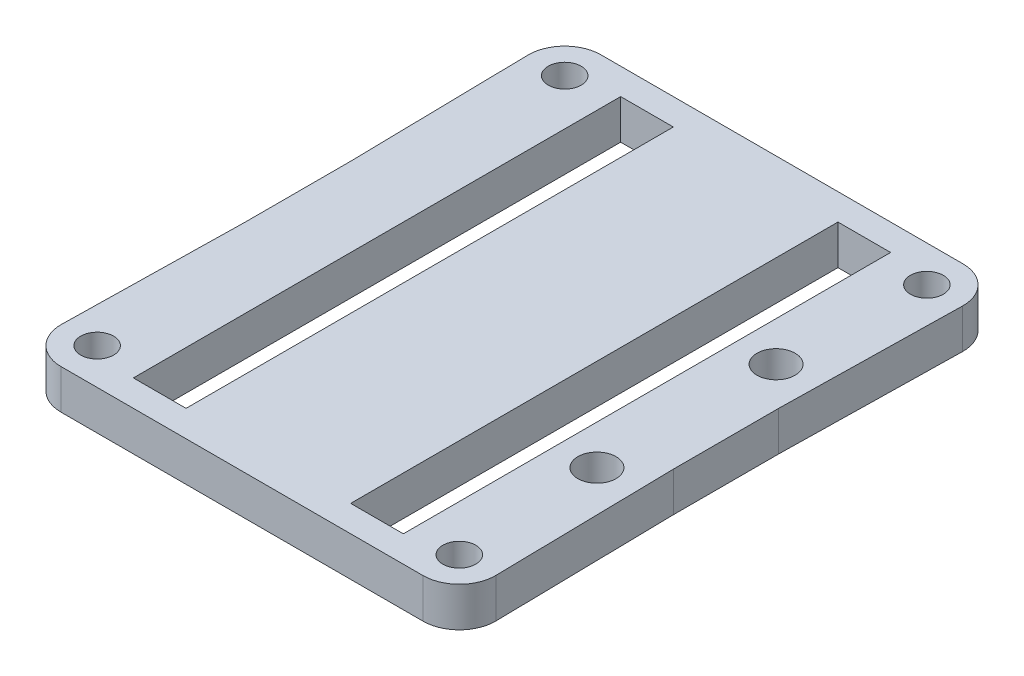
ISO-10303-21;
HEADER;
FILE_DESCRIPTION(('STEP AP214'),'2;1');
FILE_NAME('part.step','',(''),(''),'','','');
FILE_SCHEMA(('AUTOMOTIVE_DESIGN { 1 0 10303 214 1 1 1 1 }'));
ENDSEC;
DATA;
#1=APPLICATION_CONTEXT('core data for automotive mechanical design processes');
#2=APPLICATION_PROTOCOL_DEFINITION('international standard','automotive_design',2000,#1);
#3=PRODUCT_CONTEXT('',#1,'mechanical');
#4=PRODUCT('Part','Part','',(#3));
#5=PRODUCT_RELATED_PRODUCT_CATEGORY('part','',(#4));
#6=PRODUCT_DEFINITION_FORMATION('','',#4);
#7=PRODUCT_DEFINITION_CONTEXT('part definition',#1,'design');
#8=PRODUCT_DEFINITION('design','',#6,#7);
#9=PRODUCT_DEFINITION_SHAPE('','',#8);
#10=(LENGTH_UNIT() NAMED_UNIT(*) SI_UNIT(.MILLI.,.METRE.));
#11=(NAMED_UNIT(*) PLANE_ANGLE_UNIT() SI_UNIT($,.RADIAN.));
#12=(NAMED_UNIT(*) SI_UNIT($,.STERADIAN.) SOLID_ANGLE_UNIT());
#13=UNCERTAINTY_MEASURE_WITH_UNIT(LENGTH_MEASURE(1.E-05),#10,'distance_accuracy_value','');
#14=(GEOMETRIC_REPRESENTATION_CONTEXT(3) GLOBAL_UNCERTAINTY_ASSIGNED_CONTEXT((#13)) GLOBAL_UNIT_ASSIGNED_CONTEXT((#10,
#11,#12)) REPRESENTATION_CONTEXT('',''));
#15=CARTESIAN_POINT('',(0.,0.,0.));
#16=DIRECTION('',(0.,0.,1.));
#17=DIRECTION('',(1.,0.,0.));
#18=AXIS2_PLACEMENT_3D('',#15,#16,#17);
#19=CARTESIAN_POINT('',(-16.1717744553945,3.,-0.294568775175375));
#20=DIRECTION('',(0.999834148265548,0.,0.0182119730426275));
#21=DIRECTION('',(0.0182119730426275,0.,-0.999834148265549));
#22=AXIS2_PLACEMENT_3D('',#19,#20,#21);
#23=PLANE('',#22);
#24=DIRECTION('',(-0.0182119730426275,0.,0.999834148265549));
#25=VECTOR('',#24,1.);
#26=CARTESIAN_POINT('',(-16.1717744553945,0.,-0.294568775175375));
#27=LINE('',#26,#25);
#28=CARTESIAN_POINT('',(-16.25,0.,4.));
#29=VERTEX_POINT('',#28);
#30=CARTESIAN_POINT('',(-16.4995439077303,0.,17.6999170741328));
#31=VERTEX_POINT('',#30);
#32=EDGE_CURVE('E259',#29,#31,#27,.T.);
#33=ORIENTED_EDGE('',*,*,#32,.T.);
#34=DIRECTION('',(0.,-1.,0.));
#35=VECTOR('',#34,1.);
#36=CARTESIAN_POINT('',(-16.4995439077303,3.,17.6999170741328));
#37=LINE('',#36,#35);
#38=CARTESIAN_POINT('',(-16.4995439077303,3.,17.6999170741328));
#39=VERTEX_POINT('',#38);
#40=EDGE_CURVE('E11',#39,#31,#37,.T.);
#41=ORIENTED_EDGE('',*,*,#40,.F.);
#42=DIRECTION('',(-0.0182119730426275,0.,0.999834148265549));
#43=VECTOR('',#42,1.);
#44=CARTESIAN_POINT('',(-16.1717744553945,3.,-0.294568775175375));
#45=LINE('',#44,#43);
#46=CARTESIAN_POINT('',(-16.25,3.,4.));
#47=VERTEX_POINT('',#46);
#48=EDGE_CURVE('E476',#47,#39,#45,.T.);
#49=ORIENTED_EDGE('',*,*,#48,.F.);
#50=DIRECTION('',(0.,-1.,0.));
#51=VECTOR('',#50,1.);
#52=CARTESIAN_POINT('',(-16.25,3.,4.));
#53=LINE('',#52,#51);
#54=EDGE_CURVE('E300',#47,#29,#53,.T.);
#55=ORIENTED_EDGE('',*,*,#54,.T.);
#56=EDGE_LOOP('',(#33,#41,#49,#55));
#57=FACE_BOUND('',#56,.T.);
#58=ADVANCED_FACE('F42',(#57),#23,.F.);
#59=CARTESIAN_POINT('',(-13.75,3.,17.75));
#60=DIRECTION('',(0.,-1.,0.));
#61=DIRECTION('',(0.,0.,-1.));
#62=AXIS2_PLACEMENT_3D('',#59,#60,#61);
#63=CYLINDRICAL_SURFACE('',#62,2.75);
#64=CARTESIAN_POINT('',(-13.75,0.,17.75));
#65=DIRECTION('',(0.,1.,0.));
#66=DIRECTION('',(0.,0.,1.));
#67=AXIS2_PLACEMENT_3D('',#64,#65,#66);
#68=CIRCLE('',#67,2.75);
#69=CARTESIAN_POINT('',(-13.75,0.,20.5));
#70=VERTEX_POINT('',#69);
#71=EDGE_CURVE('E263',#31,#70,#68,.T.);
#72=ORIENTED_EDGE('',*,*,#71,.T.);
#73=DIRECTION('',(0.,-1.,0.));
#74=VECTOR('',#73,1.);
#75=CARTESIAN_POINT('',(-13.75,3.,20.5));
#76=LINE('',#75,#74);
#77=CARTESIAN_POINT('',(-13.75,3.,20.5));
#78=VERTEX_POINT('',#77);
#79=EDGE_CURVE('E53',#78,#70,#76,.T.);
#80=ORIENTED_EDGE('',*,*,#79,.F.);
#81=CARTESIAN_POINT('',(-13.75,3.,17.75));
#82=DIRECTION('',(0.,1.,0.));
#83=DIRECTION('',(0.,0.,1.));
#84=AXIS2_PLACEMENT_3D('',#81,#82,#83);
#85=CIRCLE('',#84,2.75);
#86=EDGE_CURVE('E479',#39,#78,#85,.T.);
#87=ORIENTED_EDGE('',*,*,#86,.F.);
#88=ORIENTED_EDGE('',*,*,#40,.T.);
#89=EDGE_LOOP('',(#72,#80,#87,#88));
#90=FACE_BOUND('',#89,.T.);
#91=ADVANCED_FACE('F388',(#90),#63,.T.);
#92=CARTESIAN_POINT('',(0.,3.,20.5));
#93=DIRECTION('',(0.,0.,1.));
#94=DIRECTION('',(1.,0.,0.));
#95=AXIS2_PLACEMENT_3D('',#92,#93,#94);
#96=PLANE('',#95);
#97=DIRECTION('',(-1.,0.,0.));
#98=VECTOR('',#97,1.);
#99=CARTESIAN_POINT('',(0.,0.,20.5));
#100=LINE('',#99,#98);
#101=CARTESIAN_POINT('',(13.75,0.,20.5));
#102=VERTEX_POINT('',#101);
#103=EDGE_CURVE('E267',#102,#70,#100,.T.);
#104=ORIENTED_EDGE('',*,*,#103,.F.);
#105=DIRECTION('',(0.,-1.,0.));
#106=VECTOR('',#105,1.);
#107=CARTESIAN_POINT('',(13.75,3.,20.5));
#108=LINE('',#107,#106);
#109=CARTESIAN_POINT('',(13.75,3.,20.5));
#110=VERTEX_POINT('',#109);
#111=EDGE_CURVE('E326',#110,#102,#108,.T.);
#112=ORIENTED_EDGE('',*,*,#111,.F.);
#113=DIRECTION('',(-1.,0.,0.));
#114=VECTOR('',#113,1.);
#115=CARTESIAN_POINT('',(0.,3.,20.5));
#116=LINE('',#115,#114);
#117=EDGE_CURVE('E482',#110,#78,#116,.T.);
#118=ORIENTED_EDGE('',*,*,#117,.T.);
#119=ORIENTED_EDGE('',*,*,#79,.T.);
#120=EDGE_LOOP('',(#104,#112,#118,#119));
#121=FACE_BOUND('',#120,.T.);
#122=ADVANCED_FACE('F394',(#121),#96,.T.);
#123=CARTESIAN_POINT('',(13.75,3.,17.75));
#124=DIRECTION('',(0.,-1.,0.));
#125=DIRECTION('',(0.,0.,-1.));
#126=AXIS2_PLACEMENT_3D('',#123,#124,#125);
#127=CYLINDRICAL_SURFACE('',#126,2.75);
#128=CARTESIAN_POINT('',(13.75,0.,17.75));
#129=DIRECTION('',(0.,1.,0.));
#130=DIRECTION('',(0.,0.,1.));
#131=AXIS2_PLACEMENT_3D('',#128,#129,#130);
#132=CIRCLE('',#131,2.75);
#133=CARTESIAN_POINT('',(16.4995439077303,0.,17.6999170741328));
#134=VERTEX_POINT('',#133);
#135=EDGE_CURVE('E271',#134,#102,#132,.F.);
#136=ORIENTED_EDGE('',*,*,#135,.F.);
#137=DIRECTION('',(0.,-1.,0.));
#138=VECTOR('',#137,1.);
#139=CARTESIAN_POINT('',(16.4995439077303,3.,17.6999170741328));
#140=LINE('',#139,#138);
#141=CARTESIAN_POINT('',(16.4995439077303,3.,17.6999170741328));
#142=VERTEX_POINT('',#141);
#143=EDGE_CURVE('E323',#142,#134,#140,.T.);
#144=ORIENTED_EDGE('',*,*,#143,.F.);
#145=CARTESIAN_POINT('',(13.75,3.,17.75));
#146=DIRECTION('',(0.,1.,0.));
#147=DIRECTION('',(0.,0.,1.));
#148=AXIS2_PLACEMENT_3D('',#145,#146,#147);
#149=CIRCLE('',#148,2.75);
#150=EDGE_CURVE('E486',#142,#110,#149,.F.);
#151=ORIENTED_EDGE('',*,*,#150,.T.);
#152=ORIENTED_EDGE('',*,*,#111,.T.);
#153=EDGE_LOOP('',(#136,#144,#151,#152));
#154=FACE_BOUND('',#153,.T.);
#155=ADVANCED_FACE('F560',(#154),#127,.T.);
#156=CARTESIAN_POINT('',(16.1717744553945,3.,-0.294568775175375));
#157=DIRECTION('',(0.999834148265548,0.,-0.0182119730426275));
#158=DIRECTION('',(-0.0182119730426275,0.,-0.999834148265549));
#159=AXIS2_PLACEMENT_3D('',#156,#157,#158);
#160=PLANE('',#159);
#161=DIRECTION('',(0.0182119730426275,0.,0.999834148265549));
#162=VECTOR('',#161,1.);
#163=CARTESIAN_POINT('',(16.1717744553945,0.,-0.294568775175375));
#164=LINE('',#163,#162);
#165=CARTESIAN_POINT('',(16.25,0.,4.));
#166=VERTEX_POINT('',#165);
#167=EDGE_CURVE('E275',#166,#134,#164,.T.);
#168=ORIENTED_EDGE('',*,*,#167,.F.);
#169=DIRECTION('',(0.,-1.,0.));
#170=VECTOR('',#169,1.);
#171=CARTESIAN_POINT('',(16.25,3.,4.));
#172=LINE('',#171,#170);
#173=CARTESIAN_POINT('',(16.25,3.,4.));
#174=VERTEX_POINT('',#173);
#175=EDGE_CURVE('E320',#174,#166,#172,.T.);
#176=ORIENTED_EDGE('',*,*,#175,.F.);
#177=DIRECTION('',(0.0182119730426275,0.,0.999834148265549));
#178=VECTOR('',#177,1.);
#179=CARTESIAN_POINT('',(16.1717744553945,3.,-0.294568775175375));
#180=LINE('',#179,#178);
#181=EDGE_CURVE('E490',#174,#142,#180,.T.);
#182=ORIENTED_EDGE('',*,*,#181,.T.);
#183=ORIENTED_EDGE('',*,*,#143,.T.);
#184=EDGE_LOOP('',(#168,#176,#182,#183));
#185=FACE_BOUND('',#184,.T.);
#186=ADVANCED_FACE('F556',(#185),#160,.T.);
#187=CARTESIAN_POINT('',(16.25,3.,0.));
#188=DIRECTION('',(-1.,0.,0.));
#189=DIRECTION('',(0.,0.,1.));
#190=AXIS2_PLACEMENT_3D('',#187,#188,#189);
#191=PLANE('',#190);
#192=DIRECTION('',(0.,0.,-1.));
#193=VECTOR('',#192,1.);
#194=CARTESIAN_POINT('',(16.25,0.,0.));
#195=LINE('',#194,#193);
#196=CARTESIAN_POINT('',(16.25,0.,-4.));
#197=VERTEX_POINT('',#196);
#198=EDGE_CURVE('E279',#166,#197,#195,.T.);
#199=ORIENTED_EDGE('',*,*,#198,.T.);
#200=DIRECTION('',(0.,-1.,0.));
#201=VECTOR('',#200,1.);
#202=CARTESIAN_POINT('',(16.25,3.,-4.));
#203=LINE('',#202,#201);
#204=CARTESIAN_POINT('',(16.25,3.,-4.));
#205=VERTEX_POINT('',#204);
#206=EDGE_CURVE('E316',#205,#197,#203,.T.);
#207=ORIENTED_EDGE('',*,*,#206,.F.);
#208=DIRECTION('',(0.,0.,-1.));
#209=VECTOR('',#208,1.);
#210=CARTESIAN_POINT('',(16.25,3.,0.));
#211=LINE('',#210,#209);
#212=EDGE_CURVE('E494',#174,#205,#211,.T.);
#213=ORIENTED_EDGE('',*,*,#212,.F.);
#214=ORIENTED_EDGE('',*,*,#175,.T.);
#215=EDGE_LOOP('',(#199,#207,#213,#214));
#216=FACE_BOUND('',#215,.T.);
#217=ADVANCED_FACE('F552',(#216),#191,.F.);
#218=CARTESIAN_POINT('',(16.1717744553945,3.,0.294568775175375));
#219=DIRECTION('',(-0.999834148265548,0.,-0.0182119730426275));
#220=DIRECTION('',(-0.0182119730426275,0.,0.999834148265549));
#221=AXIS2_PLACEMENT_3D('',#218,#219,#220);
#222=PLANE('',#221);
#223=DIRECTION('',(0.0182119730426275,0.,-0.999834148265549));
#224=VECTOR('',#223,1.);
#225=CARTESIAN_POINT('',(16.1717744553945,0.,0.294568775175375));
#226=LINE('',#225,#224);
#227=CARTESIAN_POINT('',(16.4995439077303,0.,-17.6999170741328));
#228=VERTEX_POINT('',#227);
#229=EDGE_CURVE('E282',#197,#228,#226,.T.);
#230=ORIENTED_EDGE('',*,*,#229,.T.);
#231=DIRECTION('',(0.,-1.,0.));
#232=VECTOR('',#231,1.);
#233=CARTESIAN_POINT('',(16.4995439077303,3.,-17.6999170741328));
#234=LINE('',#233,#232);
#235=CARTESIAN_POINT('',(16.4995439077303,3.,-17.6999170741328));
#236=VERTEX_POINT('',#235);
#237=EDGE_CURVE('E312',#236,#228,#234,.T.);
#238=ORIENTED_EDGE('',*,*,#237,.F.);
#239=DIRECTION('',(0.0182119730426275,0.,-0.999834148265549));
#240=VECTOR('',#239,1.);
#241=CARTESIAN_POINT('',(16.1717744553945,3.,0.294568775175375));
#242=LINE('',#241,#240);
#243=EDGE_CURVE('E497',#205,#236,#242,.T.);
#244=ORIENTED_EDGE('',*,*,#243,.F.);
#245=ORIENTED_EDGE('',*,*,#206,.T.);
#246=EDGE_LOOP('',(#230,#238,#244,#245));
#247=FACE_BOUND('',#246,.T.);
#248=ADVANCED_FACE('F548',(#247),#222,.F.);
#249=CARTESIAN_POINT('',(13.75,3.,-17.75));
#250=DIRECTION('',(0.,-1.,0.));
#251=DIRECTION('',(0.,0.,-1.));
#252=AXIS2_PLACEMENT_3D('',#249,#250,#251);
#253=CYLINDRICAL_SURFACE('',#252,2.75);
#254=CARTESIAN_POINT('',(13.75,0.,-17.75));
#255=DIRECTION('',(0.,1.,0.));
#256=DIRECTION('',(0.,0.,1.));
#257=AXIS2_PLACEMENT_3D('',#254,#255,#256);
#258=CIRCLE('',#257,2.75);
#259=CARTESIAN_POINT('',(13.75,0.,-20.5));
#260=VERTEX_POINT('',#259);
#261=EDGE_CURVE('E285',#228,#260,#258,.T.);
#262=ORIENTED_EDGE('',*,*,#261,.T.);
#263=DIRECTION('',(0.,-1.,0.));
#264=VECTOR('',#263,1.);
#265=CARTESIAN_POINT('',(13.75,3.,-20.5));
#266=LINE('',#265,#264);
#267=CARTESIAN_POINT('',(13.75,3.,-20.5));
#268=VERTEX_POINT('',#267);
#269=EDGE_CURVE('E308',#268,#260,#266,.T.);
#270=ORIENTED_EDGE('',*,*,#269,.F.);
#271=CARTESIAN_POINT('',(13.75,3.,-17.75));
#272=DIRECTION('',(0.,1.,0.));
#273=DIRECTION('',(0.,0.,1.));
#274=AXIS2_PLACEMENT_3D('',#271,#272,#273);
#275=CIRCLE('',#274,2.75);
#276=EDGE_CURVE('E500',#236,#268,#275,.T.);
#277=ORIENTED_EDGE('',*,*,#276,.F.);
#278=ORIENTED_EDGE('',*,*,#237,.T.);
#279=EDGE_LOOP('',(#262,#270,#277,#278));
#280=FACE_BOUND('',#279,.T.);
#281=ADVANCED_FACE('F544',(#280),#253,.T.);
#282=CARTESIAN_POINT('',(0.,3.,-20.5));
#283=DIRECTION('',(0.,0.,1.));
#284=DIRECTION('',(1.,0.,0.));
#285=AXIS2_PLACEMENT_3D('',#282,#283,#284);
#286=PLANE('',#285);
#287=DIRECTION('',(-1.,0.,0.));
#288=VECTOR('',#287,1.);
#289=CARTESIAN_POINT('',(0.,0.,-20.5));
#290=LINE('',#289,#288);
#291=CARTESIAN_POINT('',(-13.75,0.,-20.5));
#292=VERTEX_POINT('',#291);
#293=EDGE_CURVE('E288',#260,#292,#290,.T.);
#294=ORIENTED_EDGE('',*,*,#293,.T.);
#295=DIRECTION('',(0.,-1.,0.));
#296=VECTOR('',#295,1.);
#297=CARTESIAN_POINT('',(-13.75,3.,-20.5));
#298=LINE('',#297,#296);
#299=CARTESIAN_POINT('',(-13.75,3.,-20.5));
#300=VERTEX_POINT('',#299);
#301=EDGE_CURVE('E200',#300,#292,#298,.T.);
#302=ORIENTED_EDGE('',*,*,#301,.F.);
#303=DIRECTION('',(-1.,0.,0.));
#304=VECTOR('',#303,1.);
#305=CARTESIAN_POINT('',(0.,3.,-20.5));
#306=LINE('',#305,#304);
#307=EDGE_CURVE('E205',#268,#300,#306,.T.);
#308=ORIENTED_EDGE('',*,*,#307,.F.);
#309=ORIENTED_EDGE('',*,*,#269,.T.);
#310=EDGE_LOOP('',(#294,#302,#308,#309));
#311=FACE_BOUND('',#310,.T.);
#312=ADVANCED_FACE('F541',(#311),#286,.F.);
#313=CARTESIAN_POINT('',(-13.75,3.,-17.75));
#314=DIRECTION('',(0.,-1.,0.));
#315=DIRECTION('',(0.,0.,-1.));
#316=AXIS2_PLACEMENT_3D('',#313,#314,#315);
#317=CYLINDRICAL_SURFACE('',#316,2.75);
#318=CARTESIAN_POINT('',(-13.75,0.,-17.75));
#319=DIRECTION('',(0.,1.,0.));
#320=DIRECTION('',(0.,0.,1.));
#321=AXIS2_PLACEMENT_3D('',#318,#319,#320);
#322=CIRCLE('',#321,2.75);
#323=CARTESIAN_POINT('',(-16.4995439077303,0.,-17.6999170741328));
#324=VERTEX_POINT('',#323);
#325=EDGE_CURVE('E194',#324,#292,#322,.F.);
#326=ORIENTED_EDGE('',*,*,#325,.F.);
#327=DIRECTION('',(0.,-1.,0.));
#328=VECTOR('',#327,1.);
#329=CARTESIAN_POINT('',(-16.4995439077303,3.,-17.6999170741328));
#330=LINE('',#329,#328);
#331=CARTESIAN_POINT('',(-16.4995439077303,3.,-17.6999170741328));
#332=VERTEX_POINT('',#331);
#333=EDGE_CURVE('E189',#332,#324,#330,.T.);
#334=ORIENTED_EDGE('',*,*,#333,.F.);
#335=CARTESIAN_POINT('',(-13.75,3.,-17.75));
#336=DIRECTION('',(0.,1.,0.));
#337=DIRECTION('',(0.,0.,1.));
#338=AXIS2_PLACEMENT_3D('',#335,#336,#337);
#339=CIRCLE('',#338,2.75);
#340=EDGE_CURVE('E192',#332,#300,#339,.F.);
#341=ORIENTED_EDGE('',*,*,#340,.T.);
#342=ORIENTED_EDGE('',*,*,#301,.T.);
#343=EDGE_LOOP('',(#326,#334,#341,#342));
#344=FACE_BOUND('',#343,.T.);
#345=ADVANCED_FACE('F191',(#344),#317,.T.);
#346=CARTESIAN_POINT('',(-16.1717744553945,3.,0.294568775175375));
#347=DIRECTION('',(-0.999834148265548,0.,0.0182119730426275));
#348=DIRECTION('',(0.0182119730426275,0.,0.999834148265549));
#349=AXIS2_PLACEMENT_3D('',#346,#347,#348);
#350=PLANE('',#349);
#351=DIRECTION('',(-0.0182119730426275,0.,-0.999834148265549));
#352=VECTOR('',#351,1.);
#353=CARTESIAN_POINT('',(-16.1717744553945,0.,0.294568775175375));
#354=LINE('',#353,#352);
#355=CARTESIAN_POINT('',(-16.25,0.,-4.));
#356=VERTEX_POINT('',#355);
#357=EDGE_CURVE('E294',#356,#324,#354,.T.);
#358=ORIENTED_EDGE('',*,*,#357,.F.);
#359=DIRECTION('',(0.,-1.,0.));
#360=VECTOR('',#359,1.);
#361=CARTESIAN_POINT('',(-16.25,3.,-4.));
#362=LINE('',#361,#360);
#363=CARTESIAN_POINT('',(-16.25,3.,-4.));
#364=VERTEX_POINT('',#363);
#365=EDGE_CURVE('E126',#364,#356,#362,.T.);
#366=ORIENTED_EDGE('',*,*,#365,.F.);
#367=DIRECTION('',(-0.0182119730426275,0.,-0.999834148265549));
#368=VECTOR('',#367,1.);
#369=CARTESIAN_POINT('',(-16.1717744553945,3.,0.294568775175375));
#370=LINE('',#369,#368);
#371=EDGE_CURVE('E203',#364,#332,#370,.T.);
#372=ORIENTED_EDGE('',*,*,#371,.T.);
#373=ORIENTED_EDGE('',*,*,#333,.T.);
#374=EDGE_LOOP('',(#358,#366,#372,#373));
#375=FACE_BOUND('',#374,.T.);
#376=ADVANCED_FACE('F209',(#375),#350,.T.);
#377=CARTESIAN_POINT('',(0.,3.,-18.5));
#378=DIRECTION('',(0.,0.,1.));
#379=DIRECTION('',(1.,0.,0.));
#380=AXIS2_PLACEMENT_3D('',#377,#378,#379);
#381=PLANE('',#380);
#382=DIRECTION('',(-1.,0.,0.));
#383=VECTOR('',#382,1.);
#384=CARTESIAN_POINT('',(0.,0.,-18.5));
#385=LINE('',#384,#383);
#386=CARTESIAN_POINT('',(10.25,0.,-18.5));
#387=VERTEX_POINT('',#386);
#388=CARTESIAN_POINT('',(6.25,0.,-18.5));
#389=VERTEX_POINT('',#388);
#390=EDGE_CURVE('E223',#387,#389,#385,.T.);
#391=ORIENTED_EDGE('',*,*,#390,.F.);
#392=DIRECTION('',(0.,-1.,0.));
#393=VECTOR('',#392,1.);
#394=CARTESIAN_POINT('',(10.25,3.,-18.5));
#395=LINE('',#394,#393);
#396=CARTESIAN_POINT('',(10.25,3.,-18.5));
#397=VERTEX_POINT('',#396);
#398=EDGE_CURVE('E303',#397,#387,#395,.T.);
#399=ORIENTED_EDGE('',*,*,#398,.F.);
#400=DIRECTION('',(-1.,0.,0.));
#401=VECTOR('',#400,1.);
#402=CARTESIAN_POINT('',(0.,3.,-18.5));
#403=LINE('',#402,#401);
#404=CARTESIAN_POINT('',(6.25,3.,-18.5));
#405=VERTEX_POINT('',#404);
#406=EDGE_CURVE('E444',#397,#405,#403,.T.);
#407=ORIENTED_EDGE('',*,*,#406,.T.);
#408=DIRECTION('',(0.,-1.,0.));
#409=VECTOR('',#408,1.);
#410=CARTESIAN_POINT('',(6.25,3.,-18.5));
#411=LINE('',#410,#409);
#412=EDGE_CURVE('E331',#405,#389,#411,.T.);
#413=ORIENTED_EDGE('',*,*,#412,.T.);
#414=EDGE_LOOP('',(#391,#399,#407,#413));
#415=FACE_BOUND('',#414,.T.);
#416=ADVANCED_FACE('F509',(#415),#381,.T.);
#417=CARTESIAN_POINT('',(10.25,3.,0.));
#418=DIRECTION('',(1.,0.,0.));
#419=DIRECTION('',(0.,0.,-1.));
#420=AXIS2_PLACEMENT_3D('',#417,#418,#419);
#421=PLANE('',#420);
#422=DIRECTION('',(0.,0.,1.));
#423=VECTOR('',#422,1.);
#424=CARTESIAN_POINT('',(10.25,0.,0.));
#425=LINE('',#424,#423);
#426=CARTESIAN_POINT('',(10.25,0.,18.5));
#427=VERTEX_POINT('',#426);
#428=EDGE_CURVE('E243',#387,#427,#425,.T.);
#429=ORIENTED_EDGE('',*,*,#428,.T.);
#430=DIRECTION('',(0.,-1.,0.));
#431=VECTOR('',#430,1.);
#432=CARTESIAN_POINT('',(10.25,3.,18.5));
#433=LINE('',#432,#431);
#434=CARTESIAN_POINT('',(10.25,3.,18.5));
#435=VERTEX_POINT('',#434);
#436=EDGE_CURVE('E337',#435,#427,#433,.T.);
#437=ORIENTED_EDGE('',*,*,#436,.F.);
#438=DIRECTION('',(0.,0.,1.));
#439=VECTOR('',#438,1.);
#440=CARTESIAN_POINT('',(10.25,3.,0.));
#441=LINE('',#440,#439);
#442=EDGE_CURVE('E461',#397,#435,#441,.T.);
#443=ORIENTED_EDGE('',*,*,#442,.F.);
#444=ORIENTED_EDGE('',*,*,#398,.T.);
#445=EDGE_LOOP('',(#429,#437,#443,#444));
#446=FACE_BOUND('',#445,.T.);
#447=ADVANCED_FACE('F385',(#446),#421,.F.);
#448=CARTESIAN_POINT('',(0.,3.,18.5));
#449=DIRECTION('',(0.,0.,1.));
#450=DIRECTION('',(1.,0.,0.));
#451=AXIS2_PLACEMENT_3D('',#448,#449,#450);
#452=PLANE('',#451);
#453=DIRECTION('',(-1.,0.,0.));
#454=VECTOR('',#453,1.);
#455=CARTESIAN_POINT('',(0.,0.,18.5));
#456=LINE('',#455,#454);
#457=CARTESIAN_POINT('',(6.25,0.,18.5));
#458=VERTEX_POINT('',#457);
#459=EDGE_CURVE('E231',#427,#458,#456,.T.);
#460=ORIENTED_EDGE('',*,*,#459,.T.);
#461=DIRECTION('',(0.,-1.,0.));
#462=VECTOR('',#461,1.);
#463=CARTESIAN_POINT('',(6.25,3.,18.5));
#464=LINE('',#463,#462);
#465=CARTESIAN_POINT('',(6.25,3.,18.5));
#466=VERTEX_POINT('',#465);
#467=EDGE_CURVE('E334',#466,#458,#464,.T.);
#468=ORIENTED_EDGE('',*,*,#467,.F.);
#469=DIRECTION('',(-1.,0.,0.));
#470=VECTOR('',#469,1.);
#471=CARTESIAN_POINT('',(0.,3.,18.5));
#472=LINE('',#471,#470);
#473=EDGE_CURVE('E450',#435,#466,#472,.T.);
#474=ORIENTED_EDGE('',*,*,#473,.F.);
#475=ORIENTED_EDGE('',*,*,#436,.T.);
#476=EDGE_LOOP('',(#460,#468,#474,#475));
#477=FACE_BOUND('',#476,.T.);
#478=ADVANCED_FACE('F374',(#477),#452,.F.);
#479=CARTESIAN_POINT('',(-6.25,0.,-18.5));
#480=VERTEX_POINT('',#479);
#481=CARTESIAN_POINT('',(-10.25,0.,-18.5));
#482=VERTEX_POINT('',#481);
#483=EDGE_CURVE('E217',#480,#482,#385,.T.);
#484=ORIENTED_EDGE('',*,*,#483,.F.);
#485=DIRECTION('',(0.,-1.,0.));
#486=VECTOR('',#485,1.);
#487=CARTESIAN_POINT('',(-6.25,3.,-18.5));
#488=LINE('',#487,#486);
#489=CARTESIAN_POINT('',(-6.25,3.,-18.5));
#490=VERTEX_POINT('',#489);
#491=EDGE_CURVE('E46',#490,#480,#488,.T.);
#492=ORIENTED_EDGE('',*,*,#491,.F.);
#493=CARTESIAN_POINT('',(-10.25,3.,-18.5));
#494=VERTEX_POINT('',#493);
#495=EDGE_CURVE('E299',#490,#494,#403,.T.);
#496=ORIENTED_EDGE('',*,*,#495,.T.);
#497=DIRECTION('',(0.,-1.,0.));
#498=VECTOR('',#497,1.);
#499=CARTESIAN_POINT('',(-10.25,3.,-18.5));
#500=LINE('',#499,#498);
#501=EDGE_CURVE('E213',#494,#482,#500,.T.);
#502=ORIENTED_EDGE('',*,*,#501,.T.);
#503=EDGE_LOOP('',(#484,#492,#496,#502));
#504=FACE_BOUND('',#503,.T.);
#505=ADVANCED_FACE('F363',(#504),#381,.T.);
#506=CARTESIAN_POINT('',(-6.25,3.,0.));
#507=DIRECTION('',(1.,0.,0.));
#508=DIRECTION('',(0.,0.,-1.));
#509=AXIS2_PLACEMENT_3D('',#506,#507,#508);
#510=PLANE('',#509);
#511=DIRECTION('',(0.,0.,1.));
#512=VECTOR('',#511,1.);
#513=CARTESIAN_POINT('',(-6.25,0.,0.));
#514=LINE('',#513,#512);
#515=CARTESIAN_POINT('',(-6.25,0.,18.5));
#516=VERTEX_POINT('',#515);
#517=EDGE_CURVE('E221',#480,#516,#514,.T.);
#518=ORIENTED_EDGE('',*,*,#517,.T.);
#519=DIRECTION('',(0.,-1.,0.));
#520=VECTOR('',#519,1.);
#521=CARTESIAN_POINT('',(-6.25,3.,18.5));
#522=LINE('',#521,#520);
#523=CARTESIAN_POINT('',(-6.25,3.,18.5));
#524=VERTEX_POINT('',#523);
#525=EDGE_CURVE('E347',#524,#516,#522,.T.);
#526=ORIENTED_EDGE('',*,*,#525,.F.);
#527=DIRECTION('',(0.,0.,1.));
#528=VECTOR('',#527,1.);
#529=CARTESIAN_POINT('',(-6.25,3.,0.));
#530=LINE('',#529,#528);
#531=EDGE_CURVE('E357',#490,#524,#530,.T.);
#532=ORIENTED_EDGE('',*,*,#531,.F.);
#533=ORIENTED_EDGE('',*,*,#491,.T.);
#534=EDGE_LOOP('',(#518,#526,#532,#533));
#535=FACE_BOUND('',#534,.T.);
#536=ADVANCED_FACE('F44',(#535),#510,.F.);
#537=CARTESIAN_POINT('',(-10.25,0.,18.5));
#538=VERTEX_POINT('',#537);
#539=EDGE_CURVE('E226',#516,#538,#456,.T.);
#540=ORIENTED_EDGE('',*,*,#539,.T.);
#541=DIRECTION('',(0.,-1.,0.));
#542=VECTOR('',#541,1.);
#543=CARTESIAN_POINT('',(-10.25,3.,18.5));
#544=LINE('',#543,#542);
#545=CARTESIAN_POINT('',(-10.25,3.,18.5));
#546=VERTEX_POINT('',#545);
#547=EDGE_CURVE('E345',#546,#538,#544,.T.);
#548=ORIENTED_EDGE('',*,*,#547,.F.);
#549=EDGE_CURVE('E447',#524,#546,#472,.T.);
#550=ORIENTED_EDGE('',*,*,#549,.F.);
#551=ORIENTED_EDGE('',*,*,#525,.T.);
#552=EDGE_LOOP('',(#540,#548,#550,#551));
#553=FACE_BOUND('',#552,.T.);
#554=ADVANCED_FACE('F370',(#553),#452,.F.);
#555=CARTESIAN_POINT('',(13.75,3.,17.75));
#556=DIRECTION('',(0.,-1.,0.));
#557=DIRECTION('',(0.,0.,-1.));
#558=AXIS2_PLACEMENT_3D('',#555,#556,#557);
#559=CYLINDRICAL_SURFACE('',#558,1.25);
#560=CARTESIAN_POINT('',(13.75,3.,17.75));
#561=DIRECTION('',(0.,1.,0.));
#562=DIRECTION('',(0.,0.,1.));
#563=AXIS2_PLACEMENT_3D('',#560,#561,#562);
#564=CIRCLE('',#563,1.25);
#565=CARTESIAN_POINT('',(13.75,3.,19.));
#566=VERTEX_POINT('',#565);
#567=EDGE_CURVE('E472',#566,#566,#564,.F.);
#568=ORIENTED_EDGE('',*,*,#567,.F.);
#569=EDGE_LOOP('',(#568));
#570=FACE_BOUND('',#569,.T.);
#571=CARTESIAN_POINT('',(13.75,0.,17.75));
#572=DIRECTION('',(0.,1.,0.));
#573=DIRECTION('',(0.,0.,1.));
#574=AXIS2_PLACEMENT_3D('',#571,#572,#573);
#575=CIRCLE('',#574,1.25);
#576=CARTESIAN_POINT('',(13.75,0.,19.));
#577=VERTEX_POINT('',#576);
#578=EDGE_CURVE('E255',#577,#577,#575,.F.);
#579=ORIENTED_EDGE('',*,*,#578,.T.);
#580=EDGE_LOOP('',(#579));
#581=FACE_BOUND('',#580,.T.);
#582=ADVANCED_FACE('F372',(#570,#581),#559,.F.);
#583=CARTESIAN_POINT('',(13.75,3.,-17.75));
#584=DIRECTION('',(0.,-1.,0.));
#585=DIRECTION('',(0.,0.,-1.));
#586=AXIS2_PLACEMENT_3D('',#583,#584,#585);
#587=CYLINDRICAL_SURFACE('',#586,1.25);
#588=CARTESIAN_POINT('',(13.75,3.,-17.75));
#589=DIRECTION('',(0.,1.,0.));
#590=DIRECTION('',(0.,0.,1.));
#591=AXIS2_PLACEMENT_3D('',#588,#589,#590);
#592=CIRCLE('',#591,1.25);
#593=CARTESIAN_POINT('',(13.75,3.,-16.5));
#594=VERTEX_POINT('',#593);
#595=EDGE_CURVE('E468',#594,#594,#592,.T.);
#596=ORIENTED_EDGE('',*,*,#595,.T.);
#597=EDGE_LOOP('',(#596));
#598=FACE_BOUND('',#597,.T.);
#599=CARTESIAN_POINT('',(13.75,0.,-17.75));
#600=DIRECTION('',(0.,1.,0.));
#601=DIRECTION('',(0.,0.,1.));
#602=AXIS2_PLACEMENT_3D('',#599,#600,#601);
#603=CIRCLE('',#602,1.25);
#604=CARTESIAN_POINT('',(13.75,0.,-16.5));
#605=VERTEX_POINT('',#604);
#606=EDGE_CURVE('E251',#605,#605,#603,.T.);
#607=ORIENTED_EDGE('',*,*,#606,.F.);
#608=EDGE_LOOP('',(#607));
#609=FACE_BOUND('',#608,.T.);
#610=ADVANCED_FACE('F379',(#598,#609),#587,.F.);
#611=CARTESIAN_POINT('',(6.25,3.,0.));
#612=DIRECTION('',(1.,0.,0.));
#613=DIRECTION('',(0.,0.,-1.));
#614=AXIS2_PLACEMENT_3D('',#611,#612,#613);
#615=PLANE('',#614);
#616=DIRECTION('',(0.,0.,1.));
#617=VECTOR('',#616,1.);
#618=CARTESIAN_POINT('',(6.25,0.,0.));
#619=LINE('',#618,#617);
#620=EDGE_CURVE('E247',#389,#458,#619,.T.);
#621=ORIENTED_EDGE('',*,*,#620,.F.);
#622=ORIENTED_EDGE('',*,*,#412,.F.);
#623=DIRECTION('',(0.,0.,1.));
#624=VECTOR('',#623,1.);
#625=CARTESIAN_POINT('',(6.25,3.,0.));
#626=LINE('',#625,#624);
#627=EDGE_CURVE('E465',#405,#466,#626,.T.);
#628=ORIENTED_EDGE('',*,*,#627,.T.);
#629=ORIENTED_EDGE('',*,*,#467,.T.);
#630=EDGE_LOOP('',(#621,#622,#628,#629));
#631=FACE_BOUND('',#630,.T.);
#632=ADVANCED_FACE('F400',(#631),#615,.T.);
#633=CARTESIAN_POINT('',(-13.75,3.,-17.75));
#634=DIRECTION('',(0.,-1.,0.));
#635=DIRECTION('',(0.,0.,-1.));
#636=AXIS2_PLACEMENT_3D('',#633,#634,#635);
#637=CYLINDRICAL_SURFACE('',#636,1.25000000000001);
#638=CARTESIAN_POINT('',(-13.75,3.,-17.75));
#639=DIRECTION('',(0.,1.,0.));
#640=DIRECTION('',(0.,0.,1.));
#641=AXIS2_PLACEMENT_3D('',#638,#639,#640);
#642=CIRCLE('',#641,1.25000000000001);
#643=CARTESIAN_POINT('',(-13.75,3.,-16.5));
#644=VERTEX_POINT('',#643);
#645=EDGE_CURVE('E457',#644,#644,#642,.F.);
#646=ORIENTED_EDGE('',*,*,#645,.F.);
#647=EDGE_LOOP('',(#646));
#648=FACE_BOUND('',#647,.T.);
#649=CARTESIAN_POINT('',(-13.75,0.,-17.75));
#650=DIRECTION('',(0.,1.,0.));
#651=DIRECTION('',(0.,0.,1.));
#652=AXIS2_PLACEMENT_3D('',#649,#650,#651);
#653=CIRCLE('',#652,1.25000000000001);
#654=CARTESIAN_POINT('',(-13.75,0.,-16.5));
#655=VERTEX_POINT('',#654);
#656=EDGE_CURVE('E239',#655,#655,#653,.F.);
#657=ORIENTED_EDGE('',*,*,#656,.T.);
#658=EDGE_LOOP('',(#657));
#659=FACE_BOUND('',#658,.T.);
#660=ADVANCED_FACE('F403',(#648,#659),#637,.F.);
#661=CARTESIAN_POINT('',(-13.75,3.,17.75));
#662=DIRECTION('',(0.,-1.,0.));
#663=DIRECTION('',(0.,0.,-1.));
#664=AXIS2_PLACEMENT_3D('',#661,#662,#663);
#665=CYLINDRICAL_SURFACE('',#664,1.25);
#666=CARTESIAN_POINT('',(-13.75,3.,17.75));
#667=DIRECTION('',(0.,1.,0.));
#668=DIRECTION('',(0.,0.,1.));
#669=AXIS2_PLACEMENT_3D('',#666,#667,#668);
#670=CIRCLE('',#669,1.25);
#671=CARTESIAN_POINT('',(-13.75,3.,19.));
#672=VERTEX_POINT('',#671);
#673=EDGE_CURVE('E453',#672,#672,#670,.T.);
#674=ORIENTED_EDGE('',*,*,#673,.T.);
#675=EDGE_LOOP('',(#674));
#676=FACE_BOUND('',#675,.T.);
#677=CARTESIAN_POINT('',(-13.75,0.,17.75));
#678=DIRECTION('',(0.,1.,0.));
#679=DIRECTION('',(0.,0.,1.));
#680=AXIS2_PLACEMENT_3D('',#677,#678,#679);
#681=CIRCLE('',#680,1.25);
#682=CARTESIAN_POINT('',(-13.75,0.,19.));
#683=VERTEX_POINT('',#682);
#684=EDGE_CURVE('E235',#683,#683,#681,.T.);
#685=ORIENTED_EDGE('',*,*,#684,.F.);
#686=EDGE_LOOP('',(#685));
#687=FACE_BOUND('',#686,.T.);
#688=ADVANCED_FACE('F408',(#676,#687),#665,.F.);
#689=CARTESIAN_POINT('',(-10.25,3.,0.));
#690=DIRECTION('',(1.,0.,0.));
#691=DIRECTION('',(0.,0.,-1.));
#692=AXIS2_PLACEMENT_3D('',#689,#690,#691);
#693=PLANE('',#692);
#694=DIRECTION('',(0.,0.,1.));
#695=VECTOR('',#694,1.);
#696=CARTESIAN_POINT('',(-10.25,0.,0.));
#697=LINE('',#696,#695);
#698=EDGE_CURVE('E230',#482,#538,#697,.T.);
#699=ORIENTED_EDGE('',*,*,#698,.F.);
#700=ORIENTED_EDGE('',*,*,#501,.F.);
#701=DIRECTION('',(0.,0.,1.));
#702=VECTOR('',#701,1.);
#703=CARTESIAN_POINT('',(-10.25,3.,0.));
#704=LINE('',#703,#702);
#705=EDGE_CURVE('E368',#494,#546,#704,.T.);
#706=ORIENTED_EDGE('',*,*,#705,.T.);
#707=ORIENTED_EDGE('',*,*,#547,.T.);
#708=EDGE_LOOP('',(#699,#700,#706,#707));
#709=FACE_BOUND('',#708,.T.);
#710=ADVANCED_FACE('F367',(#709),#693,.T.);
#711=CARTESIAN_POINT('',(-16.25,3.,0.));
#712=DIRECTION('',(1.,0.,0.));
#713=DIRECTION('',(0.,0.,-1.));
#714=AXIS2_PLACEMENT_3D('',#711,#712,#713);
#715=PLANE('',#714);
#716=DIRECTION('',(0.,0.,1.));
#717=VECTOR('',#716,1.);
#718=CARTESIAN_POINT('',(-16.25,0.,0.));
#719=LINE('',#718,#717);
#720=EDGE_CURVE('E129',#356,#29,#719,.T.);
#721=ORIENTED_EDGE('',*,*,#720,.T.);
#722=ORIENTED_EDGE('',*,*,#54,.F.);
#723=DIRECTION('',(0.,0.,1.));
#724=VECTOR('',#723,1.);
#725=CARTESIAN_POINT('',(-16.25,3.,0.));
#726=LINE('',#725,#724);
#727=EDGE_CURVE('E62',#364,#47,#726,.T.);
#728=ORIENTED_EDGE('',*,*,#727,.F.);
#729=ORIENTED_EDGE('',*,*,#365,.T.);
#730=EDGE_LOOP('',(#721,#722,#728,#729));
#731=FACE_BOUND('',#730,.T.);
#732=ADVANCED_FACE('F514',(#731),#715,.F.);
#733=CARTESIAN_POINT('',(0.,3.,0.));
#734=DIRECTION('',(0.,1.,0.));
#735=DIRECTION('',(0.,0.,1.));
#736=AXIS2_PLACEMENT_3D('',#733,#734,#735);
#737=PLANE('',#736);
#738=CARTESIAN_POINT('',(13.25,3.,-6.8));
#739=DIRECTION('',(0.,-1.,0.));
#740=DIRECTION('',(0.,0.,-1.));
#741=AXIS2_PLACEMENT_3D('',#738,#739,#740);
#742=CIRCLE('',#741,1.45);
#743=CARTESIAN_POINT('',(13.25,3.,-8.25));
#744=VERTEX_POINT('',#743);
#745=EDGE_CURVE('E431',#744,#744,#742,.T.);
#746=ORIENTED_EDGE('',*,*,#745,.T.);
#747=EDGE_LOOP('',(#746));
#748=FACE_BOUND('',#747,.T.);
#749=CARTESIAN_POINT('',(13.25,3.,6.8));
#750=DIRECTION('',(0.,-1.,0.));
#751=DIRECTION('',(0.,0.,-1.));
#752=AXIS2_PLACEMENT_3D('',#749,#750,#751);
#753=CIRCLE('',#752,1.45);
#754=CARTESIAN_POINT('',(13.25,3.,5.35));
#755=VERTEX_POINT('',#754);
#756=EDGE_CURVE('E222',#755,#755,#753,.T.);
#757=ORIENTED_EDGE('',*,*,#756,.T.);
#758=EDGE_LOOP('',(#757));
#759=FACE_BOUND('',#758,.T.);
#760=ORIENTED_EDGE('',*,*,#495,.F.);
#761=ORIENTED_EDGE('',*,*,#531,.T.);
#762=ORIENTED_EDGE('',*,*,#549,.T.);
#763=ORIENTED_EDGE('',*,*,#705,.F.);
#764=EDGE_LOOP('',(#760,#761,#762,#763));
#765=FACE_BOUND('',#764,.T.);
#766=ORIENTED_EDGE('',*,*,#673,.F.);
#767=EDGE_LOOP('',(#766));
#768=FACE_BOUND('',#767,.T.);
#769=ORIENTED_EDGE('',*,*,#645,.T.);
#770=EDGE_LOOP('',(#769));
#771=FACE_BOUND('',#770,.T.);
#772=ORIENTED_EDGE('',*,*,#406,.F.);
#773=ORIENTED_EDGE('',*,*,#442,.T.);
#774=ORIENTED_EDGE('',*,*,#473,.T.);
#775=ORIENTED_EDGE('',*,*,#627,.F.);
#776=EDGE_LOOP('',(#772,#773,#774,#775));
#777=FACE_BOUND('',#776,.T.);
#778=ORIENTED_EDGE('',*,*,#595,.F.);
#779=EDGE_LOOP('',(#778));
#780=FACE_BOUND('',#779,.T.);
#781=ORIENTED_EDGE('',*,*,#567,.T.);
#782=EDGE_LOOP('',(#781));
#783=FACE_BOUND('',#782,.T.);
#784=ORIENTED_EDGE('',*,*,#48,.T.);
#785=ORIENTED_EDGE('',*,*,#86,.T.);
#786=ORIENTED_EDGE('',*,*,#117,.F.);
#787=ORIENTED_EDGE('',*,*,#150,.F.);
#788=ORIENTED_EDGE('',*,*,#181,.F.);
#789=ORIENTED_EDGE('',*,*,#212,.T.);
#790=ORIENTED_EDGE('',*,*,#243,.T.);
#791=ORIENTED_EDGE('',*,*,#276,.T.);
#792=ORIENTED_EDGE('',*,*,#307,.T.);
#793=ORIENTED_EDGE('',*,*,#340,.F.);
#794=ORIENTED_EDGE('',*,*,#371,.F.);
#795=ORIENTED_EDGE('',*,*,#727,.T.);
#796=EDGE_LOOP('',(#784,#785,#786,#787,#788,#789,#790,#791,#792,#793,#794,#795));
#797=FACE_BOUND('',#796,.T.);
#798=ADVANCED_FACE('F202',(#748,#759,#765,#768,#771,#777,#780,#783,#797),#737,.T.);
#799=CARTESIAN_POINT('',(0.,0.,0.));
#800=DIRECTION('',(0.,1.,0.));
#801=DIRECTION('',(0.,0.,1.));
#802=AXIS2_PLACEMENT_3D('',#799,#800,#801);
#803=PLANE('',#802);
#804=CARTESIAN_POINT('',(13.25,0.,-6.8));
#805=DIRECTION('',(0.,-1.,0.));
#806=DIRECTION('',(0.,0.,-1.));
#807=AXIS2_PLACEMENT_3D('',#804,#805,#806);
#808=CIRCLE('',#807,1.44999999999999);
#809=CARTESIAN_POINT('',(13.25,0.,-8.24999999999999));
#810=VERTEX_POINT('',#809);
#811=EDGE_CURVE('E435',#810,#810,#808,.T.);
#812=ORIENTED_EDGE('',*,*,#811,.F.);
#813=EDGE_LOOP('',(#812));
#814=FACE_BOUND('',#813,.T.);
#815=CARTESIAN_POINT('',(13.25,0.,6.8));
#816=DIRECTION('',(0.,-1.,0.));
#817=DIRECTION('',(0.,0.,-1.));
#818=AXIS2_PLACEMENT_3D('',#815,#816,#817);
#819=CIRCLE('',#818,1.44999999999999);
#820=CARTESIAN_POINT('',(13.25,0.,5.35000000000001));
#821=VERTEX_POINT('',#820);
#822=EDGE_CURVE('E427',#821,#821,#819,.T.);
#823=ORIENTED_EDGE('',*,*,#822,.F.);
#824=EDGE_LOOP('',(#823));
#825=FACE_BOUND('',#824,.T.);
#826=ORIENTED_EDGE('',*,*,#483,.T.);
#827=ORIENTED_EDGE('',*,*,#698,.T.);
#828=ORIENTED_EDGE('',*,*,#539,.F.);
#829=ORIENTED_EDGE('',*,*,#517,.F.);
#830=EDGE_LOOP('',(#826,#827,#828,#829));
#831=FACE_BOUND('',#830,.T.);
#832=ORIENTED_EDGE('',*,*,#684,.T.);
#833=EDGE_LOOP('',(#832));
#834=FACE_BOUND('',#833,.T.);
#835=ORIENTED_EDGE('',*,*,#656,.F.);
#836=EDGE_LOOP('',(#835));
#837=FACE_BOUND('',#836,.T.);
#838=ORIENTED_EDGE('',*,*,#390,.T.);
#839=ORIENTED_EDGE('',*,*,#620,.T.);
#840=ORIENTED_EDGE('',*,*,#459,.F.);
#841=ORIENTED_EDGE('',*,*,#428,.F.);
#842=EDGE_LOOP('',(#838,#839,#840,#841));
#843=FACE_BOUND('',#842,.T.);
#844=ORIENTED_EDGE('',*,*,#606,.T.);
#845=EDGE_LOOP('',(#844));
#846=FACE_BOUND('',#845,.T.);
#847=ORIENTED_EDGE('',*,*,#578,.F.);
#848=EDGE_LOOP('',(#847));
#849=FACE_BOUND('',#848,.T.);
#850=ORIENTED_EDGE('',*,*,#32,.F.);
#851=ORIENTED_EDGE('',*,*,#720,.F.);
#852=ORIENTED_EDGE('',*,*,#357,.T.);
#853=ORIENTED_EDGE('',*,*,#325,.T.);
#854=ORIENTED_EDGE('',*,*,#293,.F.);
#855=ORIENTED_EDGE('',*,*,#261,.F.);
#856=ORIENTED_EDGE('',*,*,#229,.F.);
#857=ORIENTED_EDGE('',*,*,#198,.F.);
#858=ORIENTED_EDGE('',*,*,#167,.T.);
#859=ORIENTED_EDGE('',*,*,#135,.T.);
#860=ORIENTED_EDGE('',*,*,#103,.T.);
#861=ORIENTED_EDGE('',*,*,#71,.F.);
#862=EDGE_LOOP('',(#850,#851,#852,#853,#854,#855,#856,#857,#858,#859,#860,#861));
#863=FACE_BOUND('',#862,.T.);
#864=ADVANCED_FACE('F360',(#814,#825,#831,#834,#837,#843,#846,#849,#863),#803,.F.);
#865=CARTESIAN_POINT('',(13.25,0.,6.8));
#866=DIRECTION('',(0.,-1.,0.));
#867=DIRECTION('',(0.,0.,-1.));
#868=AXIS2_PLACEMENT_3D('',#865,#866,#867);
#869=CYLINDRICAL_SURFACE('',#868,1.44999999999999);
#870=ORIENTED_EDGE('',*,*,#756,.F.);
#871=EDGE_LOOP('',(#870));
#872=FACE_BOUND('',#871,.T.);
#873=ORIENTED_EDGE('',*,*,#822,.T.);
#874=EDGE_LOOP('',(#873));
#875=FACE_BOUND('',#874,.T.);
#876=ADVANCED_FACE('F525',(#872,#875),#869,.F.);
#877=CARTESIAN_POINT('',(13.25,0.,-6.8));
#878=DIRECTION('',(0.,-1.,0.));
#879=DIRECTION('',(0.,0.,-1.));
#880=AXIS2_PLACEMENT_3D('',#877,#878,#879);
#881=CYLINDRICAL_SURFACE('',#880,1.44999999999999);
#882=ORIENTED_EDGE('',*,*,#745,.F.);
#883=EDGE_LOOP('',(#882));
#884=FACE_BOUND('',#883,.T.);
#885=ORIENTED_EDGE('',*,*,#811,.T.);
#886=EDGE_LOOP('',(#885));
#887=FACE_BOUND('',#886,.T.);
#888=ADVANCED_FACE('F714',(#884,#887),#881,.F.);
#889=CLOSED_SHELL('',(#58,#91,#122,#155,#186,#217,#248,#281,#312,#345,#376,#416,#447,#478,#505,
#536,#554,#582,#610,#632,#660,#688,#710,#732,#798,#864,#876,#888));
#890=MANIFOLD_SOLID_BREP('B2',#889);
#891=ADVANCED_BREP_SHAPE_REPRESENTATION('',(#18,#890),#14);
#892=SHAPE_DEFINITION_REPRESENTATION(#9,#891);
ENDSEC;
END-ISO-10303-21;
